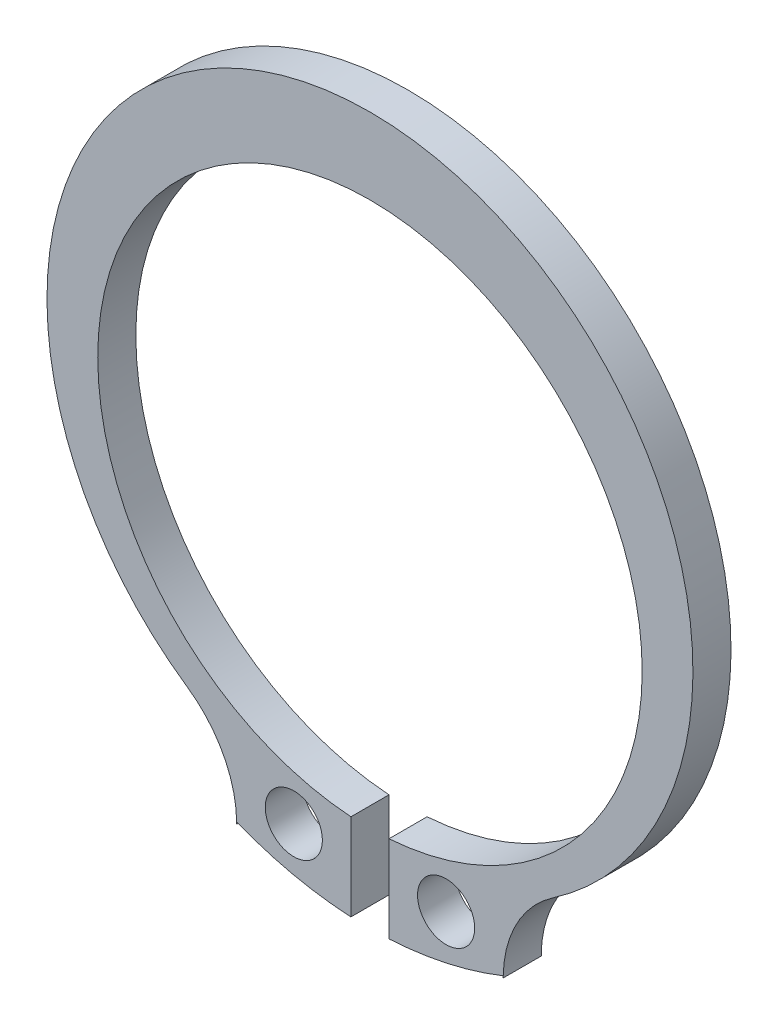
ISO-10303-21;
HEADER;
FILE_DESCRIPTION(('STEP AP214'),'2;1');
FILE_NAME('part.step','',(''),(''),'','','');
FILE_SCHEMA(('AUTOMOTIVE_DESIGN { 1 0 10303 214 1 1 1 1 }'));
ENDSEC;
DATA;
#1=APPLICATION_CONTEXT('core data for automotive mechanical design processes');
#2=APPLICATION_PROTOCOL_DEFINITION('international standard','automotive_design',2000,#1);
#3=PRODUCT_CONTEXT('',#1,'mechanical');
#4=PRODUCT('Part','Part','',(#3));
#5=PRODUCT_RELATED_PRODUCT_CATEGORY('part','',(#4));
#6=PRODUCT_DEFINITION_FORMATION('','',#4);
#7=PRODUCT_DEFINITION_CONTEXT('part definition',#1,'design');
#8=PRODUCT_DEFINITION('design','',#6,#7);
#9=PRODUCT_DEFINITION_SHAPE('','',#8);
#10=(LENGTH_UNIT() NAMED_UNIT(*) SI_UNIT(.MILLI.,.METRE.));
#11=(NAMED_UNIT(*) PLANE_ANGLE_UNIT() SI_UNIT($,.RADIAN.));
#12=(NAMED_UNIT(*) SI_UNIT($,.STERADIAN.) SOLID_ANGLE_UNIT());
#13=UNCERTAINTY_MEASURE_WITH_UNIT(LENGTH_MEASURE(1.E-05),#10,'distance_accuracy_value','');
#14=(GEOMETRIC_REPRESENTATION_CONTEXT(3) GLOBAL_UNCERTAINTY_ASSIGNED_CONTEXT((#13)) GLOBAL_UNIT_ASSIGNED_CONTEXT((#10,
#11,#12)) REPRESENTATION_CONTEXT('',''));
#15=CARTESIAN_POINT('',(0.,0.,0.));
#16=DIRECTION('',(0.,0.,1.));
#17=DIRECTION('',(1.,0.,0.));
#18=AXIS2_PLACEMENT_3D('',#15,#16,#17);
#19=CARTESIAN_POINT('',(-3.00000000000002,-1.66745992903083,0.));
#20=DIRECTION('',(0.999999999999998,0.,0.));
#21=DIRECTION('',(0.,0.,-1.));
#22=AXIS2_PLACEMENT_3D('',#19,#20,#21);
#23=PLANE('',#22);
#24=DIRECTION('',(0.,0.,1.));
#25=VECTOR('',#24,1.);
#26=CARTESIAN_POINT('',(-3.00000000000002,-1.66745992903083,0.));
#27=LINE('',#26,#25);
#28=CARTESIAN_POINT('',(-3.00000000000002,-1.66745992903083,1.));
#29=VERTEX_POINT('',#28);
#30=CARTESIAN_POINT('',(-3.00000000000002,-1.66745992903083,0.));
#31=VERTEX_POINT('',#30);
#32=EDGE_CURVE('E81',#29,#31,#27,.F.);
#33=ORIENTED_EDGE('',*,*,#32,.T.);
#34=CARTESIAN_POINT('',(-3.00000000000002,-1.66745992903083,0.));
#35=DIRECTION('',(0.,1.,0.));
#36=VECTOR('',#35,1.);
#37=LINE('',#34,#36);
#38=CARTESIAN_POINT('',(-3.00021364023451,-1.61731204158766,0.));
#39=VERTEX_POINT('',#38);
#40=EDGE_CURVE('E214',#31,#39,#37,.T.);
#41=ORIENTED_EDGE('',*,*,#40,.T.);
#42=DIRECTION('',(0.,0.,1.));
#43=VECTOR('',#42,1.);
#44=CARTESIAN_POINT('',(-2.99999999999999,-1.61746257169393,1.));
#45=LINE('',#44,#43);
#46=CARTESIAN_POINT('',(-3.00021364023451,-1.61731204158766,1.));
#47=VERTEX_POINT('',#46);
#48=EDGE_CURVE('E212',#47,#39,#45,.F.);
#49=ORIENTED_EDGE('',*,*,#48,.F.);
#50=CARTESIAN_POINT('',(-3.00000000000002,-1.61731594118083,1.));
#51=DIRECTION('',(0.,-1.,0.));
#52=VECTOR('',#51,1.);
#53=LINE('',#50,#52);
#54=EDGE_CURVE('E217',#47,#29,#53,.T.);
#55=ORIENTED_EDGE('',*,*,#54,.T.);
#56=EDGE_LOOP('',(#33,#41,#49,#55));
#57=FACE_BOUND('',#56,.T.);
#58=ADVANCED_FACE('F16',(#57),#23,.T.);
#59=CARTESIAN_POINT('',(4.00000000000009,-1.61746257169032,0.));
#60=DIRECTION('',(-0.999999999999998,0.,0.));
#61=DIRECTION('',(0.,0.,1.));
#62=AXIS2_PLACEMENT_3D('',#59,#60,#61);
#63=PLANE('',#62);
#64=DIRECTION('',(0.,0.,1.));
#65=VECTOR('',#64,1.);
#66=CARTESIAN_POINT('',(4.,-1.6174625716936,0.));
#67=LINE('',#66,#65);
#68=CARTESIAN_POINT('',(4.0002136402346,-1.61731204158766,0.));
#69=VERTEX_POINT('',#68);
#70=CARTESIAN_POINT('',(4.0002136402346,-1.61731204158766,1.));
#71=VERTEX_POINT('',#70);
#72=EDGE_CURVE('E128',#69,#71,#67,.T.);
#73=ORIENTED_EDGE('',*,*,#72,.F.);
#74=CARTESIAN_POINT('',(4.00000000000009,-1.61731594118032,0.));
#75=DIRECTION('',(0.,-1.,0.));
#76=VECTOR('',#75,1.);
#77=LINE('',#74,#76);
#78=CARTESIAN_POINT('',(3.99999999999996,-1.66745992903017,0.));
#79=VERTEX_POINT('',#78);
#80=EDGE_CURVE('E104',#69,#79,#77,.T.);
#81=ORIENTED_EDGE('',*,*,#80,.T.);
#82=DIRECTION('',(0.,0.,1.));
#83=VECTOR('',#82,1.);
#84=CARTESIAN_POINT('',(3.99999999999996,-1.66745992903017,0.));
#85=LINE('',#84,#83);
#86=CARTESIAN_POINT('',(3.99999999999996,-1.66745992903017,1.));
#87=VERTEX_POINT('',#86);
#88=EDGE_CURVE('E140',#79,#87,#85,.T.);
#89=ORIENTED_EDGE('',*,*,#88,.T.);
#90=CARTESIAN_POINT('',(4.00000000000009,-1.66745992903032,1.));
#91=DIRECTION('',(0.,1.,0.));
#92=VECTOR('',#91,1.);
#93=LINE('',#90,#92);
#94=EDGE_CURVE('E122',#87,#71,#93,.T.);
#95=ORIENTED_EDGE('',*,*,#94,.T.);
#96=EDGE_LOOP('',(#73,#81,#89,#95));
#97=FACE_BOUND('',#96,.T.);
#98=ADVANCED_FACE('F132',(#97),#63,.T.);
#99=CARTESIAN_POINT('',(0.,0.,0.));
#100=DIRECTION('',(0.,0.,1.));
#101=DIRECTION('',(0.999999999999998,0.,0.));
#102=AXIS2_PLACEMENT_3D('',#99,#100,#101);
#103=PLANE('',#102);
#104=CARTESIAN_POINT('',(2.50000000000002,-0.909541558152649,0.));
#105=DIRECTION('',(0.,0.,-1.));
#106=DIRECTION('',(-0.999999999999998,0.,0.));
#107=AXIS2_PLACEMENT_3D('',#104,#105,#106);
#108=CIRCLE('',#107,0.75);
#109=CARTESIAN_POINT('',(1.75000000000002,-0.909541558152649,0.));
#110=VERTEX_POINT('',#109);
#111=EDGE_CURVE('E191',#110,#110,#108,.F.);
#112=ORIENTED_EDGE('',*,*,#111,.T.);
#113=EDGE_LOOP('',(#112));
#114=FACE_BOUND('',#113,.T.);
#115=CARTESIAN_POINT('',(-1.5,-0.909541558151983,0.));
#116=DIRECTION('',(0.,0.,1.));
#117=DIRECTION('',(0.999999999999998,0.,0.));
#118=AXIS2_PLACEMENT_3D('',#115,#116,#117);
#119=CIRCLE('',#118,0.75);
#120=CARTESIAN_POINT('',(-0.750000000000003,-0.909541558151983,0.));
#121=VERTEX_POINT('',#120);
#122=EDGE_CURVE('E130',#121,#121,#119,.T.);
#123=ORIENTED_EDGE('',*,*,#122,.T.);
#124=EDGE_LOOP('',(#123));
#125=FACE_BOUND('',#124,.T.);
#126=DIRECTION('',(0.,0.999999999999998,0.));
#127=VECTOR('',#126,1.);
#128=CARTESIAN_POINT('',(1.00000000000004,-3.33066907387547E-13,0.));
#129=LINE('',#128,#127);
#130=CARTESIAN_POINT('',(1.,-9.43689570931383E-13,0.));
#131=VERTEX_POINT('',#130);
#132=CARTESIAN_POINT('',(1.00000000000011,-2.27823058891596,0.));
#133=VERTEX_POINT('',#132);
#134=EDGE_CURVE('E136',#131,#133,#129,.F.);
#135=ORIENTED_EDGE('',*,*,#134,.F.);
#136=CARTESIAN_POINT('',(0.500000000000042,7.13249605677951,0.));
#137=DIRECTION('',(0.,0.,1.));
#138=DIRECTION('',(0.999999999999998,0.,0.));
#139=AXIS2_PLACEMENT_3D('',#136,#137,#138);
#140=CIRCLE('',#139,7.15);
#141=CARTESIAN_POINT('',(0.,-1.4432899320127E-12,0.));
#142=VERTEX_POINT('',#141);
#143=EDGE_CURVE('E66',#131,#142,#140,.T.);
#144=ORIENTED_EDGE('',*,*,#143,.T.);
#145=DIRECTION('',(0.,0.999999999999998,0.));
#146=VECTOR('',#145,1.);
#147=CARTESIAN_POINT('',(0.,-2.27823058891036,0.));
#148=LINE('',#147,#146);
#149=CARTESIAN_POINT('',(0.,-2.27823058891302,0.));
#150=VERTEX_POINT('',#149);
#151=EDGE_CURVE('E209',#150,#142,#148,.T.);
#152=ORIENTED_EDGE('',*,*,#151,.F.);
#153=CARTESIAN_POINT('',(0.500000000000042,7.13249605677951,0.));
#154=DIRECTION('',(0.,0.,1.));
#155=DIRECTION('',(0.999999999999998,0.,0.));
#156=AXIS2_PLACEMENT_3D('',#153,#154,#155);
#157=CIRCLE('',#156,9.424);
#158=EDGE_CURVE('E73',#39,#150,#157,.T.);
#159=ORIENTED_EDGE('',*,*,#158,.F.);
#160=CARTESIAN_POINT('',(-3.00043382926999,-1.61731594118,0.));
#161=CARTESIAN_POINT('',(-3.00594819159301,-1.25999100097545,0.));
#162=CARTESIAN_POINT('',(-3.09690293039278,-0.911277415092164,0.));
#163=CARTESIAN_POINT('',(-3.18770674112395,-0.563142476002941,0.));
#164=CARTESIAN_POINT('',(-3.35711649943728,-0.247883133395771,0.));
#165=CARTESIAN_POINT('',(-3.52703953464852,0.0683313805015503,0.));
#166=CARTESIAN_POINT('',(-3.76652038983472,0.335375663818823,0.));
#167=CARTESIAN_POINT('',(-4.00747674854235,0.604065276071071,0.));
#168=CARTESIAN_POINT('',(-4.30188679244999,0.805678064358998,0.));
#169=B_SPLINE_CURVE_WITH_KNOTS('',2,(#160,#161,#162,#163,#164,#165,#166,#167,#168),
.UNSPECIFIED.,.F.,.F.,(3,2,2,2,3),(0.,0.25,0.5,0.75,1.),.UNSPECIFIED.);
#170=CARTESIAN_POINT('',(-4.30188679244969,0.805678064359272,0.));
#171=VERTEX_POINT('',#170);
#172=EDGE_CURVE('E276',#39,#171,#169,.T.);
#173=ORIENTED_EDGE('',*,*,#172,.T.);
#174=CARTESIAN_POINT('',(0.499999999999931,7.79916272344949,0.));
#175=DIRECTION('',(0.,0.,1.));
#176=DIRECTION('',(0.566037735848713,-0.824379331130556,0.));
#177=AXIS2_PLACEMENT_3D('',#174,#175,#176);
#178=CIRCLE('',#177,8.48333333332998);
#179=CARTESIAN_POINT('',(5.3018867924492,0.805678064359494,0.));
#180=VERTEX_POINT('',#179);
#181=EDGE_CURVE('E116',#180,#171,#178,.T.);
#182=ORIENTED_EDGE('',*,*,#181,.F.);
#183=CARTESIAN_POINT('',(5.30188679244999,0.805678064358998,0.));
#184=CARTESIAN_POINT('',(5.00702099750541,0.603753176537706,0.));
#185=CARTESIAN_POINT('',(4.76652038983593,0.335375663820207,0.));
#186=CARTESIAN_POINT('',(4.52640715971023,0.0674304303500996,0.));
#187=CARTESIAN_POINT('',(4.3571164994373,-0.247883133395757,0.));
#188=CARTESIAN_POINT('',(4.18730476589032,-0.564167225998586,0.));
#189=CARTESIAN_POINT('',(4.09690293039246,-0.911277415093345,0.));
#190=CARTESIAN_POINT('',(4.00593966868138,-1.26054327677991,0.));
#191=CARTESIAN_POINT('',(4.00043382926999,-1.61731594118,0.));
#192=B_SPLINE_CURVE_WITH_KNOTS('',2,(#183,#184,#185,#186,#187,#188,#189,#190,#191),
.UNSPECIFIED.,.F.,.F.,(3,2,2,2,3),(0.,0.25,0.5,0.75,1.),.UNSPECIFIED.);
#193=EDGE_CURVE('E110',#180,#69,#192,.T.);
#194=ORIENTED_EDGE('',*,*,#193,.T.);
#195=CARTESIAN_POINT('',(0.500000000000042,7.13249605677951,0.));
#196=DIRECTION('',(0.,0.,1.));
#197=DIRECTION('',(0.999999999999998,0.,0.));
#198=AXIS2_PLACEMENT_3D('',#195,#196,#197);
#199=CIRCLE('',#198,9.424);
#200=EDGE_CURVE('E114',#133,#69,#199,.T.);
#201=ORIENTED_EDGE('',*,*,#200,.F.);
#202=EDGE_LOOP('',(#135,#144,#152,#159,#173,#182,#194,#201));
#203=FACE_BOUND('',#202,.T.);
#204=ADVANCED_FACE('F113',(#114,#125,#203),#103,.F.);
#205=CARTESIAN_POINT('',(6.99999999999995,-1.6674599290305,0.));
#206=DIRECTION('',(0.,0.,1.));
#207=DIRECTION('',(0.999999999999998,0.,0.));
#208=AXIS2_PLACEMENT_3D('',#205,#206,#207);
#209=CYLINDRICAL_SURFACE('',#208,3.);
#210=DIRECTION('',(0.,0.,1.));
#211=VECTOR('',#210,1.);
#212=CARTESIAN_POINT('',(5.30188679244802,0.805678064361215,0.));
#213=LINE('',#212,#211);
#214=CARTESIAN_POINT('',(5.3018867924495,0.805678064361992,1.));
#215=VERTEX_POINT('',#214);
#216=EDGE_CURVE('E121',#215,#180,#213,.F.);
#217=ORIENTED_EDGE('',*,*,#216,.F.);
#218=CARTESIAN_POINT('',(6.99999999999995,-1.6674599290305,1.));
#219=DIRECTION('',(0.,0.,1.));
#220=DIRECTION('',(0.999999999999998,0.,0.));
#221=AXIS2_PLACEMENT_3D('',#218,#219,#220);
#222=CIRCLE('',#221,3.);
#223=EDGE_CURVE('E186',#71,#215,#222,.F.);
#224=ORIENTED_EDGE('',*,*,#223,.F.);
#225=ORIENTED_EDGE('',*,*,#94,.F.);
#226=ORIENTED_EDGE('',*,*,#88,.F.);
#227=ORIENTED_EDGE('',*,*,#80,.F.);
#228=ORIENTED_EDGE('',*,*,#193,.F.);
#229=EDGE_LOOP('',(#217,#224,#225,#226,#227,#228));
#230=FACE_BOUND('',#229,.T.);
#231=ADVANCED_FACE('F139',(#230),#209,.F.);
#232=CARTESIAN_POINT('',(0.499999999999931,7.79916272344949,0.));
#233=DIRECTION('',(0.,0.,1.));
#234=DIRECTION('',(0.999999999999998,0.,0.));
#235=AXIS2_PLACEMENT_3D('',#232,#233,#234);
#236=CYLINDRICAL_SURFACE('',#235,8.48333333333);
#237=ORIENTED_EDGE('',*,*,#216,.T.);
#238=ORIENTED_EDGE('',*,*,#181,.T.);
#239=DIRECTION('',(0.,0.,1.));
#240=VECTOR('',#239,1.);
#241=CARTESIAN_POINT('',(-4.30188679245005,0.805678064358162,0.));
#242=LINE('',#241,#240);
#243=CARTESIAN_POINT('',(-4.30188679245136,0.805678064359494,1.));
#244=VERTEX_POINT('',#243);
#245=EDGE_CURVE('E219',#171,#244,#242,.T.);
#246=ORIENTED_EDGE('',*,*,#245,.T.);
#247=CARTESIAN_POINT('',(0.499999999999931,7.79916272344949,1.));
#248=DIRECTION('',(0.,0.,1.));
#249=DIRECTION('',(0.999999999999998,0.,0.));
#250=AXIS2_PLACEMENT_3D('',#247,#248,#249);
#251=CIRCLE('',#250,8.48333333333);
#252=EDGE_CURVE('E190',#215,#244,#251,.T.);
#253=ORIENTED_EDGE('',*,*,#252,.F.);
#254=EDGE_LOOP('',(#237,#238,#246,#253));
#255=FACE_BOUND('',#254,.T.);
#256=ADVANCED_FACE('F158',(#255),#236,.T.);
#257=CARTESIAN_POINT('',(-6.00000000000002,-1.6674599290305,0.));
#258=DIRECTION('',(0.,0.,1.));
#259=DIRECTION('',(0.999999999999998,0.,0.));
#260=AXIS2_PLACEMENT_3D('',#257,#258,#259);
#261=CYLINDRICAL_SURFACE('',#260,3.);
#262=ORIENTED_EDGE('',*,*,#32,.F.);
#263=ORIENTED_EDGE('',*,*,#54,.F.);
#264=CARTESIAN_POINT('',(-6.00000000000002,-1.6674599290305,1.));
#265=DIRECTION('',(0.,0.,1.));
#266=DIRECTION('',(0.999999999999998,0.,0.));
#267=AXIS2_PLACEMENT_3D('',#264,#265,#266);
#268=CIRCLE('',#267,3.);
#269=EDGE_CURVE('E193',#244,#47,#268,.F.);
#270=ORIENTED_EDGE('',*,*,#269,.F.);
#271=ORIENTED_EDGE('',*,*,#245,.F.);
#272=ORIENTED_EDGE('',*,*,#172,.F.);
#273=ORIENTED_EDGE('',*,*,#40,.F.);
#274=EDGE_LOOP('',(#262,#263,#270,#271,#272,#273));
#275=FACE_BOUND('',#274,.T.);
#276=ADVANCED_FACE('F243',(#275),#261,.F.);
#277=CARTESIAN_POINT('',(0.500000000000042,7.13249605677951,0.));
#278=DIRECTION('',(0.,0.,1.));
#279=DIRECTION('',(0.999999999999998,0.,0.));
#280=AXIS2_PLACEMENT_3D('',#277,#278,#279);
#281=CYLINDRICAL_SURFACE('',#280,9.424);
#282=ORIENTED_EDGE('',*,*,#48,.T.);
#283=ORIENTED_EDGE('',*,*,#158,.T.);
#284=DIRECTION('',(0.,0.,-1.));
#285=VECTOR('',#284,1.);
#286=CARTESIAN_POINT('',(0.,-2.27823058891036,0.));
#287=LINE('',#286,#285);
#288=CARTESIAN_POINT('',(0.,-2.27823058891302,1.));
#289=VERTEX_POINT('',#288);
#290=EDGE_CURVE('E211',#289,#150,#287,.T.);
#291=ORIENTED_EDGE('',*,*,#290,.F.);
#292=CARTESIAN_POINT('',(0.500000000000042,7.13249605677951,1.));
#293=DIRECTION('',(0.,0.,1.));
#294=DIRECTION('',(0.999999999999998,0.,0.));
#295=AXIS2_PLACEMENT_3D('',#292,#293,#294);
#296=CIRCLE('',#295,9.424);
#297=EDGE_CURVE('E295',#47,#289,#296,.T.);
#298=ORIENTED_EDGE('',*,*,#297,.F.);
#299=EDGE_LOOP('',(#282,#283,#291,#298));
#300=FACE_BOUND('',#299,.T.);
#301=ADVANCED_FACE('F252',(#300),#281,.T.);
#302=CARTESIAN_POINT('',(0.,-2.27823058891036,0.));
#303=DIRECTION('',(0.999999999999998,0.,0.));
#304=DIRECTION('',(0.,0.,-1.));
#305=AXIS2_PLACEMENT_3D('',#302,#303,#304);
#306=PLANE('',#305);
#307=ORIENTED_EDGE('',*,*,#290,.T.);
#308=ORIENTED_EDGE('',*,*,#151,.T.);
#309=DIRECTION('',(0.,0.,1.));
#310=VECTOR('',#309,1.);
#311=CARTESIAN_POINT('',(0.,-1.55431223447522E-12,0.));
#312=LINE('',#311,#310);
#313=CARTESIAN_POINT('',(0.,-1.4432899320127E-12,1.));
#314=VERTEX_POINT('',#313);
#315=EDGE_CURVE('E208',#142,#314,#312,.T.);
#316=ORIENTED_EDGE('',*,*,#315,.T.);
#317=DIRECTION('',(0.,0.999999999999998,0.));
#318=VECTOR('',#317,1.);
#319=CARTESIAN_POINT('',(0.,0.,1.));
#320=LINE('',#319,#318);
#321=EDGE_CURVE('E291',#289,#314,#320,.T.);
#322=ORIENTED_EDGE('',*,*,#321,.F.);
#323=EDGE_LOOP('',(#307,#308,#316,#322));
#324=FACE_BOUND('',#323,.T.);
#325=ADVANCED_FACE('F314',(#324),#306,.T.);
#326=CARTESIAN_POINT('',(0.500000000000042,7.13249605677951,0.));
#327=DIRECTION('',(0.,0.,1.));
#328=DIRECTION('',(0.999999999999998,0.,0.));
#329=AXIS2_PLACEMENT_3D('',#326,#327,#328);
#330=CYLINDRICAL_SURFACE('',#329,7.15);
#331=CARTESIAN_POINT('',(0.500000000000042,7.13249605677951,1.));
#332=DIRECTION('',(0.,0.,1.));
#333=DIRECTION('',(0.999999999999998,0.,0.));
#334=AXIS2_PLACEMENT_3D('',#331,#332,#333);
#335=CIRCLE('',#334,7.15);
#336=CARTESIAN_POINT('',(1.,-9.43689570931383E-13,1.));
#337=VERTEX_POINT('',#336);
#338=EDGE_CURVE('E294',#314,#337,#335,.F.);
#339=ORIENTED_EDGE('',*,*,#338,.F.);
#340=ORIENTED_EDGE('',*,*,#315,.F.);
#341=ORIENTED_EDGE('',*,*,#143,.F.);
#342=DIRECTION('',(0.,0.,1.));
#343=VECTOR('',#342,1.);
#344=CARTESIAN_POINT('',(1.00000000000004,-3.33066907387547E-13,0.));
#345=LINE('',#344,#343);
#346=EDGE_CURVE('E287',#337,#131,#345,.F.);
#347=ORIENTED_EDGE('',*,*,#346,.F.);
#348=EDGE_LOOP('',(#339,#340,#341,#347));
#349=FACE_BOUND('',#348,.T.);
#350=ADVANCED_FACE('F317',(#349),#330,.F.);
#351=CARTESIAN_POINT('',(1.00000000000004,-3.33066907387547E-13,0.));
#352=DIRECTION('',(-0.999999999999998,0.,0.));
#353=DIRECTION('',(0.,0.,1.));
#354=AXIS2_PLACEMENT_3D('',#351,#352,#353);
#355=PLANE('',#354);
#356=ORIENTED_EDGE('',*,*,#346,.T.);
#357=ORIENTED_EDGE('',*,*,#134,.T.);
#358=DIRECTION('',(0.,0.,1.));
#359=VECTOR('',#358,1.);
#360=CARTESIAN_POINT('',(1.00000000000025,-2.27823058891596,0.));
#361=LINE('',#360,#359);
#362=CARTESIAN_POINT('',(1.00000000000011,-2.27823058891596,1.));
#363=VERTEX_POINT('',#362);
#364=EDGE_CURVE('E35',#363,#133,#361,.F.);
#365=ORIENTED_EDGE('',*,*,#364,.F.);
#366=DIRECTION('',(0.,0.999999999999998,0.));
#367=VECTOR('',#366,1.);
#368=CARTESIAN_POINT('',(1.00000000000004,-3.33066907387547E-13,1.));
#369=LINE('',#368,#367);
#370=EDGE_CURVE('E296',#337,#363,#369,.F.);
#371=ORIENTED_EDGE('',*,*,#370,.F.);
#372=EDGE_LOOP('',(#356,#357,#365,#371));
#373=FACE_BOUND('',#372,.T.);
#374=ADVANCED_FACE('F318',(#373),#355,.T.);
#375=CARTESIAN_POINT('',(0.500000000000042,7.13249605677951,0.));
#376=DIRECTION('',(0.,0.,1.));
#377=DIRECTION('',(0.999999999999998,0.,0.));
#378=AXIS2_PLACEMENT_3D('',#375,#376,#377);
#379=CYLINDRICAL_SURFACE('',#378,9.424);
#380=ORIENTED_EDGE('',*,*,#364,.T.);
#381=ORIENTED_EDGE('',*,*,#200,.T.);
#382=ORIENTED_EDGE('',*,*,#72,.T.);
#383=CARTESIAN_POINT('',(0.500000000000042,7.13249605677951,1.));
#384=DIRECTION('',(0.,0.,1.));
#385=DIRECTION('',(0.999999999999998,0.,0.));
#386=AXIS2_PLACEMENT_3D('',#383,#384,#385);
#387=CIRCLE('',#386,9.424);
#388=EDGE_CURVE('E298',#363,#71,#387,.T.);
#389=ORIENTED_EDGE('',*,*,#388,.F.);
#390=EDGE_LOOP('',(#380,#381,#382,#389));
#391=FACE_BOUND('',#390,.T.);
#392=ADVANCED_FACE('F127',(#391),#379,.T.);
#393=CARTESIAN_POINT('',(-1.5,-0.909541558151983,1.));
#394=DIRECTION('',(0.,0.,1.));
#395=DIRECTION('',(0.999999999999998,0.,0.));
#396=AXIS2_PLACEMENT_3D('',#393,#394,#395);
#397=CYLINDRICAL_SURFACE('',#396,0.75);
#398=CARTESIAN_POINT('',(-1.5,-0.909541558151983,1.));
#399=DIRECTION('',(0.,0.,1.));
#400=DIRECTION('',(0.999999999999998,0.,0.));
#401=AXIS2_PLACEMENT_3D('',#398,#399,#400);
#402=CIRCLE('',#401,0.75);
#403=CARTESIAN_POINT('',(-0.750000000000003,-0.909541558151983,1.));
#404=VERTEX_POINT('',#403);
#405=EDGE_CURVE('E26',#404,#404,#402,.F.);
#406=ORIENTED_EDGE('',*,*,#405,.F.);
#407=EDGE_LOOP('',(#406));
#408=FACE_BOUND('',#407,.T.);
#409=ORIENTED_EDGE('',*,*,#122,.F.);
#410=EDGE_LOOP('',(#409));
#411=FACE_BOUND('',#410,.T.);
#412=ADVANCED_FACE('F326',(#408,#411),#397,.F.);
#413=CARTESIAN_POINT('',(2.50000000000002,-0.909541558152649,1.));
#414=DIRECTION('',(0.,0.,-1.));
#415=DIRECTION('',(-0.999999999999998,0.,0.));
#416=AXIS2_PLACEMENT_3D('',#413,#414,#415);
#417=CYLINDRICAL_SURFACE('',#416,0.75);
#418=CARTESIAN_POINT('',(2.50000000000002,-0.909541558152649,1.));
#419=DIRECTION('',(0.,0.,-1.));
#420=DIRECTION('',(-0.999999999999998,0.,0.));
#421=AXIS2_PLACEMENT_3D('',#418,#419,#420);
#422=CIRCLE('',#421,0.75);
#423=CARTESIAN_POINT('',(1.75000000000002,-0.909541558152649,1.));
#424=VERTEX_POINT('',#423);
#425=EDGE_CURVE('E11',#424,#424,#422,.T.);
#426=ORIENTED_EDGE('',*,*,#425,.F.);
#427=EDGE_LOOP('',(#426));
#428=FACE_BOUND('',#427,.T.);
#429=ORIENTED_EDGE('',*,*,#111,.F.);
#430=EDGE_LOOP('',(#429));
#431=FACE_BOUND('',#430,.T.);
#432=ADVANCED_FACE('F330',(#428,#431),#417,.F.);
#433=CARTESIAN_POINT('',(0.,0.,1.));
#434=DIRECTION('',(0.,0.,1.));
#435=DIRECTION('',(0.999999999999998,0.,0.));
#436=AXIS2_PLACEMENT_3D('',#433,#434,#435);
#437=PLANE('',#436);
#438=ORIENTED_EDGE('',*,*,#425,.T.);
#439=EDGE_LOOP('',(#438));
#440=FACE_BOUND('',#439,.T.);
#441=ORIENTED_EDGE('',*,*,#405,.T.);
#442=EDGE_LOOP('',(#441));
#443=FACE_BOUND('',#442,.T.);
#444=ORIENTED_EDGE('',*,*,#370,.T.);
#445=ORIENTED_EDGE('',*,*,#388,.T.);
#446=ORIENTED_EDGE('',*,*,#223,.T.);
#447=ORIENTED_EDGE('',*,*,#252,.T.);
#448=ORIENTED_EDGE('',*,*,#269,.T.);
#449=ORIENTED_EDGE('',*,*,#297,.T.);
#450=ORIENTED_EDGE('',*,*,#321,.T.);
#451=ORIENTED_EDGE('',*,*,#338,.T.);
#452=EDGE_LOOP('',(#444,#445,#446,#447,#448,#449,#450,#451));
#453=FACE_BOUND('',#452,.T.);
#454=ADVANCED_FACE('F311',(#440,#443,#453),#437,.T.);
#455=CLOSED_SHELL('',(#58,#98,#204,#231,#256,#276,#301,#325,#350,#374,#392,#412,#432,#454));
#456=MANIFOLD_SOLID_BREP('B1',#455);
#457=ADVANCED_BREP_SHAPE_REPRESENTATION('',(#18,#456),#14);
#458=SHAPE_DEFINITION_REPRESENTATION(#9,#457);
ENDSEC;
END-ISO-10303-21;
